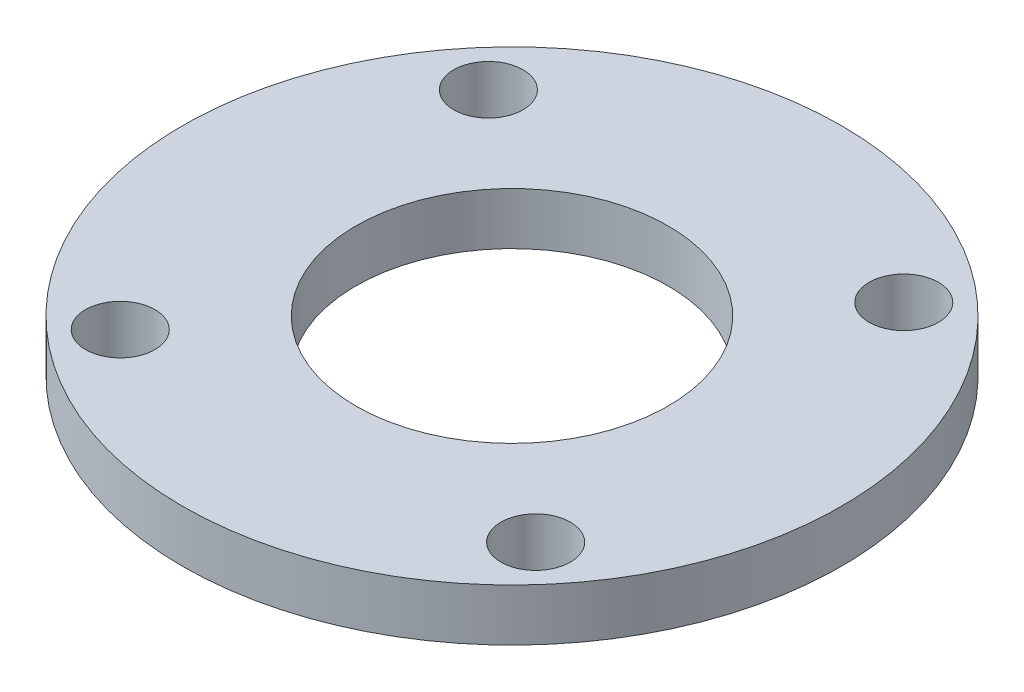
ISO-10303-21;
HEADER;
FILE_DESCRIPTION(('STEP AP214'),'2;1');
FILE_NAME('part.step','',(''),(''),'','','');
FILE_SCHEMA(('AUTOMOTIVE_DESIGN { 1 0 10303 214 1 1 1 1 }'));
ENDSEC;
DATA;
#1=APPLICATION_CONTEXT('core data for automotive mechanical design processes');
#2=APPLICATION_PROTOCOL_DEFINITION('international standard','automotive_design',2000,#1);
#3=PRODUCT_CONTEXT('',#1,'mechanical');
#4=PRODUCT('Part','Part','',(#3));
#5=PRODUCT_RELATED_PRODUCT_CATEGORY('part','',(#4));
#6=PRODUCT_DEFINITION_FORMATION('','',#4);
#7=PRODUCT_DEFINITION_CONTEXT('part definition',#1,'design');
#8=PRODUCT_DEFINITION('design','',#6,#7);
#9=PRODUCT_DEFINITION_SHAPE('','',#8);
#10=(LENGTH_UNIT() NAMED_UNIT(*) SI_UNIT(.MILLI.,.METRE.));
#11=(NAMED_UNIT(*) PLANE_ANGLE_UNIT() SI_UNIT($,.RADIAN.));
#12=(NAMED_UNIT(*) SI_UNIT($,.STERADIAN.) SOLID_ANGLE_UNIT());
#13=UNCERTAINTY_MEASURE_WITH_UNIT(LENGTH_MEASURE(1.E-05),#10,'distance_accuracy_value','');
#14=(GEOMETRIC_REPRESENTATION_CONTEXT(3) GLOBAL_UNCERTAINTY_ASSIGNED_CONTEXT((#13)) GLOBAL_UNIT_ASSIGNED_CONTEXT((#10,
#11,#12)) REPRESENTATION_CONTEXT('',''));
#15=CARTESIAN_POINT('',(0.,0.,0.));
#16=DIRECTION('',(0.,0.,1.));
#17=DIRECTION('',(1.,0.,0.));
#18=AXIS2_PLACEMENT_3D('',#15,#16,#17);
#19=CARTESIAN_POINT('',(0.,3.,0.));
#20=DIRECTION('',(0.,-1.,0.));
#21=DIRECTION('',(0.,0.,-1.));
#22=AXIS2_PLACEMENT_3D('',#19,#20,#21);
#23=CYLINDRICAL_SURFACE('',#22,19.);
#24=CARTESIAN_POINT('',(0.,3.,0.));
#25=DIRECTION('',(0.,1.,0.));
#26=DIRECTION('',(0.,0.,1.));
#27=AXIS2_PLACEMENT_3D('',#24,#25,#26);
#28=CIRCLE('',#27,19.);
#29=CARTESIAN_POINT('',(0.,3.,19.));
#30=VERTEX_POINT('',#29);
#31=EDGE_CURVE('E10',#30,#30,#28,.T.);
#32=ORIENTED_EDGE('',*,*,#31,.F.);
#33=EDGE_LOOP('',(#32));
#34=FACE_BOUND('',#33,.T.);
#35=CARTESIAN_POINT('',(0.,0.,0.));
#36=DIRECTION('',(0.,1.,0.));
#37=DIRECTION('',(0.,0.,1.));
#38=AXIS2_PLACEMENT_3D('',#35,#36,#37);
#39=CIRCLE('',#38,19.);
#40=CARTESIAN_POINT('',(0.,0.,19.));
#41=VERTEX_POINT('',#40);
#42=EDGE_CURVE('E33',#41,#41,#39,.T.);
#43=ORIENTED_EDGE('',*,*,#42,.T.);
#44=EDGE_LOOP('',(#43));
#45=FACE_BOUND('',#44,.T.);
#46=ADVANCED_FACE('F30',(#34,#45),#23,.T.);
#47=CARTESIAN_POINT('',(0.,3.,0.));
#48=DIRECTION('',(0.,1.,0.));
#49=DIRECTION('',(0.,0.,1.));
#50=AXIS2_PLACEMENT_3D('',#47,#48,#49);
#51=PLANE('',#50);
#52=CARTESIAN_POINT('',(0.,3.,0.));
#53=DIRECTION('',(0.,1.,0.));
#54=DIRECTION('',(0.,0.,1.));
#55=AXIS2_PLACEMENT_3D('',#52,#53,#54);
#56=CIRCLE('',#55,9.);
#57=CARTESIAN_POINT('',(0.,3.,9.));
#58=VERTEX_POINT('',#57);
#59=EDGE_CURVE('E66',#58,#58,#56,.T.);
#60=ORIENTED_EDGE('',*,*,#59,.F.);
#61=EDGE_LOOP('',(#60));
#62=FACE_BOUND('',#61,.T.);
#63=CARTESIAN_POINT('',(-10.6118687083263,3.,11.9744829749443));
#64=DIRECTION('',(0.,1.,0.));
#65=DIRECTION('',(0.,0.,1.));
#66=AXIS2_PLACEMENT_3D('',#63,#64,#65);
#67=CIRCLE('',#66,2.);
#68=CARTESIAN_POINT('',(-10.6118687083263,3.,13.9744829749443));
#69=VERTEX_POINT('',#68);
#70=EDGE_CURVE('E60',#69,#69,#67,.T.);
#71=ORIENTED_EDGE('',*,*,#70,.F.);
#72=EDGE_LOOP('',(#71));
#73=FACE_BOUND('',#72,.T.);
#74=CARTESIAN_POINT('',(11.9744829749449,3.,10.6118687083263));
#75=DIRECTION('',(0.,1.,0.));
#76=DIRECTION('',(0.,0.,1.));
#77=AXIS2_PLACEMENT_3D('',#74,#75,#76);
#78=CIRCLE('',#77,2.);
#79=CARTESIAN_POINT('',(11.9744829749449,3.,12.6118687083263));
#80=VERTEX_POINT('',#79);
#81=EDGE_CURVE('E54',#80,#80,#78,.T.);
#82=ORIENTED_EDGE('',*,*,#81,.F.);
#83=EDGE_LOOP('',(#82));
#84=FACE_BOUND('',#83,.T.);
#85=CARTESIAN_POINT('',(10.6118687083269,3.,-11.974482974945));
#86=DIRECTION('',(0.,1.,0.));
#87=DIRECTION('',(0.,0.,1.));
#88=AXIS2_PLACEMENT_3D('',#85,#86,#87);
#89=CIRCLE('',#88,2.);
#90=CARTESIAN_POINT('',(10.6118687083269,3.,-9.97448297494496));
#91=VERTEX_POINT('',#90);
#92=EDGE_CURVE('E48',#91,#91,#89,.T.);
#93=ORIENTED_EDGE('',*,*,#92,.F.);
#94=EDGE_LOOP('',(#93));
#95=FACE_BOUND('',#94,.T.);
#96=CARTESIAN_POINT('',(-11.9744829749443,3.,-10.6118687083269));
#97=DIRECTION('',(0.,1.,0.));
#98=DIRECTION('',(0.,0.,1.));
#99=AXIS2_PLACEMENT_3D('',#96,#97,#98);
#100=CIRCLE('',#99,2.);
#101=CARTESIAN_POINT('',(-11.9744829749443,3.,-8.61186870832694));
#102=VERTEX_POINT('',#101);
#103=EDGE_CURVE('E42',#102,#102,#100,.T.);
#104=ORIENTED_EDGE('',*,*,#103,.F.);
#105=EDGE_LOOP('',(#104));
#106=FACE_BOUND('',#105,.T.);
#107=ORIENTED_EDGE('',*,*,#31,.T.);
#108=EDGE_LOOP('',(#107));
#109=FACE_BOUND('',#108,.T.);
#110=ADVANCED_FACE('F82',(#62,#73,#84,#95,#106,#109),#51,.T.);
#111=CARTESIAN_POINT('',(0.,0.,0.));
#112=DIRECTION('',(0.,1.,0.));
#113=DIRECTION('',(0.,0.,1.));
#114=AXIS2_PLACEMENT_3D('',#111,#112,#113);
#115=PLANE('',#114);
#116=CARTESIAN_POINT('',(0.,0.,0.));
#117=DIRECTION('',(0.,1.,0.));
#118=DIRECTION('',(0.,0.,1.));
#119=AXIS2_PLACEMENT_3D('',#116,#117,#118);
#120=CIRCLE('',#119,9.);
#121=CARTESIAN_POINT('',(0.,0.,9.));
#122=VERTEX_POINT('',#121);
#123=EDGE_CURVE('E63',#122,#122,#120,.T.);
#124=ORIENTED_EDGE('',*,*,#123,.T.);
#125=EDGE_LOOP('',(#124));
#126=FACE_BOUND('',#125,.T.);
#127=CARTESIAN_POINT('',(-10.6118687083263,0.,11.9744829749443));
#128=DIRECTION('',(0.,1.,0.));
#129=DIRECTION('',(0.,0.,1.));
#130=AXIS2_PLACEMENT_3D('',#127,#128,#129);
#131=CIRCLE('',#130,2.);
#132=CARTESIAN_POINT('',(-10.6118687083263,0.,13.9744829749443));
#133=VERTEX_POINT('',#132);
#134=EDGE_CURVE('E57',#133,#133,#131,.T.);
#135=ORIENTED_EDGE('',*,*,#134,.T.);
#136=EDGE_LOOP('',(#135));
#137=FACE_BOUND('',#136,.T.);
#138=CARTESIAN_POINT('',(11.9744829749449,0.,10.6118687083263));
#139=DIRECTION('',(0.,1.,0.));
#140=DIRECTION('',(0.,0.,1.));
#141=AXIS2_PLACEMENT_3D('',#138,#139,#140);
#142=CIRCLE('',#141,2.);
#143=CARTESIAN_POINT('',(11.9744829749449,0.,12.6118687083263));
#144=VERTEX_POINT('',#143);
#145=EDGE_CURVE('E51',#144,#144,#142,.T.);
#146=ORIENTED_EDGE('',*,*,#145,.T.);
#147=EDGE_LOOP('',(#146));
#148=FACE_BOUND('',#147,.T.);
#149=CARTESIAN_POINT('',(10.6118687083269,0.,-11.974482974945));
#150=DIRECTION('',(0.,1.,0.));
#151=DIRECTION('',(0.,0.,1.));
#152=AXIS2_PLACEMENT_3D('',#149,#150,#151);
#153=CIRCLE('',#152,2.);
#154=CARTESIAN_POINT('',(10.6118687083269,0.,-9.97448297494496));
#155=VERTEX_POINT('',#154);
#156=EDGE_CURVE('E45',#155,#155,#153,.T.);
#157=ORIENTED_EDGE('',*,*,#156,.T.);
#158=EDGE_LOOP('',(#157));
#159=FACE_BOUND('',#158,.T.);
#160=CARTESIAN_POINT('',(-11.9744829749443,0.,-10.6118687083269));
#161=DIRECTION('',(0.,1.,0.));
#162=DIRECTION('',(0.,0.,1.));
#163=AXIS2_PLACEMENT_3D('',#160,#161,#162);
#164=CIRCLE('',#163,2.);
#165=CARTESIAN_POINT('',(-11.9744829749443,0.,-8.61186870832694));
#166=VERTEX_POINT('',#165);
#167=EDGE_CURVE('E40',#166,#166,#164,.T.);
#168=ORIENTED_EDGE('',*,*,#167,.T.);
#169=EDGE_LOOP('',(#168));
#170=FACE_BOUND('',#169,.T.);
#171=ORIENTED_EDGE('',*,*,#42,.F.);
#172=EDGE_LOOP('',(#171));
#173=FACE_BOUND('',#172,.T.);
#174=ADVANCED_FACE('F72',(#126,#137,#148,#159,#170,#173),#115,.F.);
#175=CARTESIAN_POINT('',(-11.9744829749443,0.,-10.6118687083269));
#176=DIRECTION('',(0.,1.,0.));
#177=DIRECTION('',(0.,0.,1.));
#178=AXIS2_PLACEMENT_3D('',#175,#176,#177);
#179=CYLINDRICAL_SURFACE('',#178,2.);
#180=ORIENTED_EDGE('',*,*,#167,.F.);
#181=EDGE_LOOP('',(#180));
#182=FACE_BOUND('',#181,.T.);
#183=ORIENTED_EDGE('',*,*,#103,.T.);
#184=EDGE_LOOP('',(#183));
#185=FACE_BOUND('',#184,.T.);
#186=ADVANCED_FACE('F94',(#182,#185),#179,.F.);
#187=CARTESIAN_POINT('',(10.6118687083269,0.,-11.974482974945));
#188=DIRECTION('',(0.,1.,0.));
#189=DIRECTION('',(0.,0.,1.));
#190=AXIS2_PLACEMENT_3D('',#187,#188,#189);
#191=CYLINDRICAL_SURFACE('',#190,2.);
#192=ORIENTED_EDGE('',*,*,#156,.F.);
#193=EDGE_LOOP('',(#192));
#194=FACE_BOUND('',#193,.T.);
#195=ORIENTED_EDGE('',*,*,#92,.T.);
#196=EDGE_LOOP('',(#195));
#197=FACE_BOUND('',#196,.T.);
#198=ADVANCED_FACE('F96',(#194,#197),#191,.F.);
#199=CARTESIAN_POINT('',(11.9744829749449,0.,10.6118687083263));
#200=DIRECTION('',(0.,1.,0.));
#201=DIRECTION('',(0.,0.,1.));
#202=AXIS2_PLACEMENT_3D('',#199,#200,#201);
#203=CYLINDRICAL_SURFACE('',#202,2.);
#204=ORIENTED_EDGE('',*,*,#145,.F.);
#205=EDGE_LOOP('',(#204));
#206=FACE_BOUND('',#205,.T.);
#207=ORIENTED_EDGE('',*,*,#81,.T.);
#208=EDGE_LOOP('',(#207));
#209=FACE_BOUND('',#208,.T.);
#210=ADVANCED_FACE('F103',(#206,#209),#203,.F.);
#211=CARTESIAN_POINT('',(-10.6118687083263,0.,11.9744829749443));
#212=DIRECTION('',(0.,1.,0.));
#213=DIRECTION('',(0.,0.,1.));
#214=AXIS2_PLACEMENT_3D('',#211,#212,#213);
#215=CYLINDRICAL_SURFACE('',#214,2.);
#216=ORIENTED_EDGE('',*,*,#134,.F.);
#217=EDGE_LOOP('',(#216));
#218=FACE_BOUND('',#217,.T.);
#219=ORIENTED_EDGE('',*,*,#70,.T.);
#220=EDGE_LOOP('',(#219));
#221=FACE_BOUND('',#220,.T.);
#222=ADVANCED_FACE('F78',(#218,#221),#215,.F.);
#223=CARTESIAN_POINT('',(0.,0.,0.));
#224=DIRECTION('',(0.,1.,0.));
#225=DIRECTION('',(0.,0.,1.));
#226=AXIS2_PLACEMENT_3D('',#223,#224,#225);
#227=CYLINDRICAL_SURFACE('',#226,9.);
#228=ORIENTED_EDGE('',*,*,#123,.F.);
#229=EDGE_LOOP('',(#228));
#230=FACE_BOUND('',#229,.T.);
#231=ORIENTED_EDGE('',*,*,#59,.T.);
#232=EDGE_LOOP('',(#231));
#233=FACE_BOUND('',#232,.T.);
#234=ADVANCED_FACE('F75',(#230,#233),#227,.F.);
#235=CLOSED_SHELL('',(#46,#110,#174,#186,#198,#210,#222,#234));
#236=MANIFOLD_SOLID_BREP('B2',#235);
#237=ADVANCED_BREP_SHAPE_REPRESENTATION('',(#18,#236),#14);
#238=SHAPE_DEFINITION_REPRESENTATION(#9,#237);
ENDSEC;
END-ISO-10303-21;
